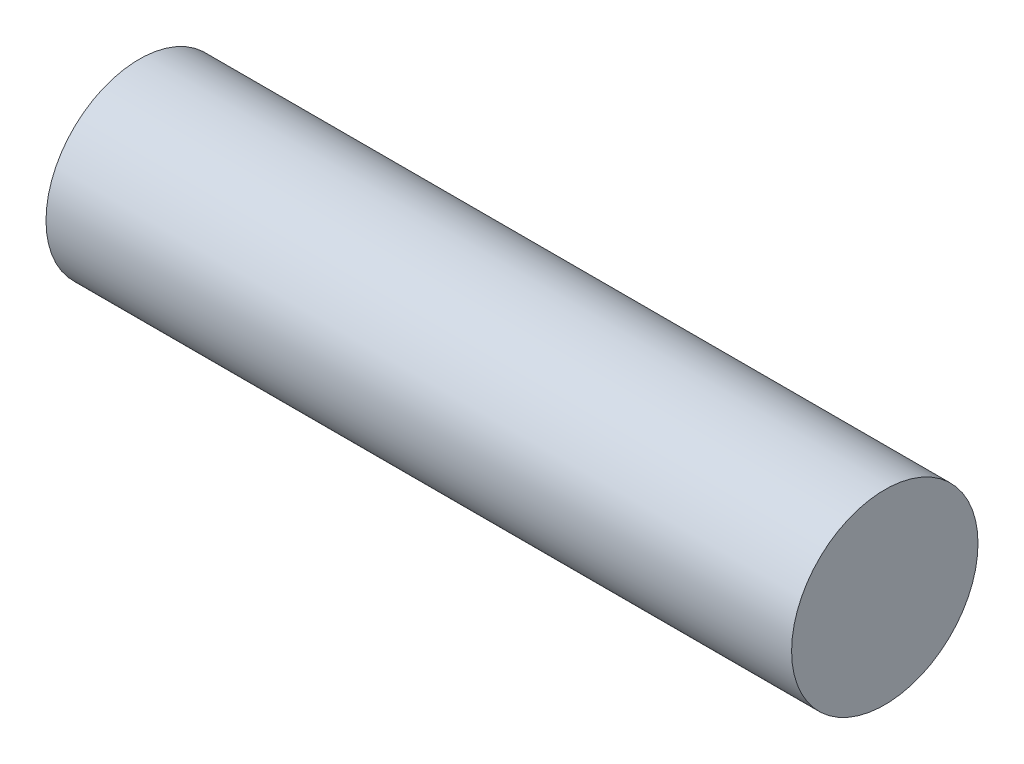
ISO-10303-21;
HEADER;
FILE_DESCRIPTION(('STEP AP214'),'2;1');
FILE_NAME('part.step','',(''),(''),'','','');
FILE_SCHEMA(('AUTOMOTIVE_DESIGN { 1 0 10303 214 1 1 1 1 }'));
ENDSEC;
DATA;
#1=APPLICATION_CONTEXT('core data for automotive mechanical design processes');
#2=APPLICATION_PROTOCOL_DEFINITION('international standard','automotive_design',2000,#1);
#3=PRODUCT_CONTEXT('',#1,'mechanical');
#4=PRODUCT('Part','Part','',(#3));
#5=PRODUCT_RELATED_PRODUCT_CATEGORY('part','',(#4));
#6=PRODUCT_DEFINITION_FORMATION('','',#4);
#7=PRODUCT_DEFINITION_CONTEXT('part definition',#1,'design');
#8=PRODUCT_DEFINITION('design','',#6,#7);
#9=PRODUCT_DEFINITION_SHAPE('','',#8);
#10=(LENGTH_UNIT() NAMED_UNIT(*) SI_UNIT(.MILLI.,.METRE.));
#11=(NAMED_UNIT(*) PLANE_ANGLE_UNIT() SI_UNIT($,.RADIAN.));
#12=(NAMED_UNIT(*) SI_UNIT($,.STERADIAN.) SOLID_ANGLE_UNIT());
#13=UNCERTAINTY_MEASURE_WITH_UNIT(LENGTH_MEASURE(1.E-05),#10,'distance_accuracy_value','');
#14=(GEOMETRIC_REPRESENTATION_CONTEXT(3) GLOBAL_UNCERTAINTY_ASSIGNED_CONTEXT((#13)) GLOBAL_UNIT_ASSIGNED_CONTEXT((#10,
#11,#12)) REPRESENTATION_CONTEXT('',''));
#15=CARTESIAN_POINT('',(0.,0.,0.));
#16=DIRECTION('',(0.,0.,1.));
#17=DIRECTION('',(1.,0.,0.));
#18=AXIS2_PLACEMENT_3D('',#15,#16,#17);
#19=CARTESIAN_POINT('',(40.,0.,0.));
#20=DIRECTION('',(-1.,0.,0.));
#21=DIRECTION('',(0.,0.,1.));
#22=AXIS2_PLACEMENT_3D('',#19,#20,#21);
#23=CYLINDRICAL_SURFACE('',#22,5.);
#24=CARTESIAN_POINT('',(40.,0.,0.));
#25=DIRECTION('',(1.,0.,0.));
#26=DIRECTION('',(0.,0.,-1.));
#27=AXIS2_PLACEMENT_3D('',#24,#25,#26);
#28=CIRCLE('',#27,5.);
#29=CARTESIAN_POINT('',(40.,0.,-5.));
#30=VERTEX_POINT('',#29);
#31=EDGE_CURVE('E10',#30,#30,#28,.T.);
#32=ORIENTED_EDGE('',*,*,#31,.F.);
#33=EDGE_LOOP('',(#32));
#34=FACE_BOUND('',#33,.T.);
#35=CARTESIAN_POINT('',(0.,0.,0.));
#36=DIRECTION('',(1.,0.,0.));
#37=DIRECTION('',(0.,0.,-1.));
#38=AXIS2_PLACEMENT_3D('',#35,#36,#37);
#39=CIRCLE('',#38,5.);
#40=CARTESIAN_POINT('',(0.,0.,-5.));
#41=VERTEX_POINT('',#40);
#42=EDGE_CURVE('E40',#41,#41,#39,.T.);
#43=ORIENTED_EDGE('',*,*,#42,.T.);
#44=EDGE_LOOP('',(#43));
#45=FACE_BOUND('',#44,.T.);
#46=ADVANCED_FACE('F37',(#34,#45),#23,.T.);
#47=CARTESIAN_POINT('',(40.,0.,0.));
#48=DIRECTION('',(1.,0.,0.));
#49=DIRECTION('',(0.,0.,-1.));
#50=AXIS2_PLACEMENT_3D('',#47,#48,#49);
#51=PLANE('',#50);
#52=ORIENTED_EDGE('',*,*,#31,.T.);
#53=EDGE_LOOP('',(#52));
#54=FACE_BOUND('',#53,.T.);
#55=ADVANCED_FACE('F54',(#54),#51,.T.);
#56=CARTESIAN_POINT('',(0.,0.,0.));
#57=DIRECTION('',(1.,0.,0.));
#58=DIRECTION('',(0.,0.,-1.));
#59=AXIS2_PLACEMENT_3D('',#56,#57,#58);
#60=PLANE('',#59);
#61=ORIENTED_EDGE('',*,*,#42,.F.);
#62=EDGE_LOOP('',(#61));
#63=FACE_BOUND('',#62,.T.);
#64=ADVANCED_FACE('F52',(#63),#60,.F.);
#65=CLOSED_SHELL('',(#46,#55,#64));
#66=MANIFOLD_SOLID_BREP('B2',#65);
#67=ADVANCED_BREP_SHAPE_REPRESENTATION('',(#18,#66),#14);
#68=SHAPE_DEFINITION_REPRESENTATION(#9,#67);
ENDSEC;
END-ISO-10303-21;
